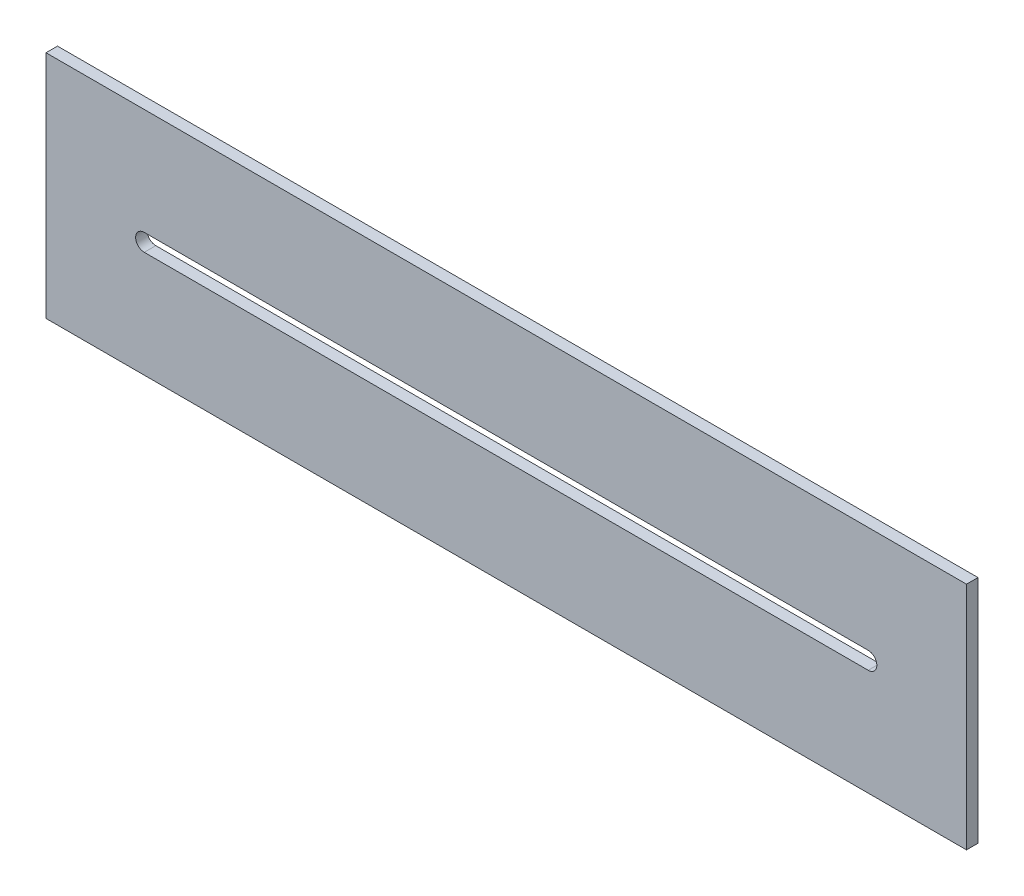
ISO-10303-21;
HEADER;
FILE_DESCRIPTION(('STEP AP214'),'2;1');
FILE_NAME('part.step','',(''),(''),'','','');
FILE_SCHEMA(('AUTOMOTIVE_DESIGN { 1 0 10303 214 1 1 1 1 }'));
ENDSEC;
DATA;
#1=APPLICATION_CONTEXT('core data for automotive mechanical design processes');
#2=APPLICATION_PROTOCOL_DEFINITION('international standard','automotive_design',2000,#1);
#3=PRODUCT_CONTEXT('',#1,'mechanical');
#4=PRODUCT('Part','Part','',(#3));
#5=PRODUCT_RELATED_PRODUCT_CATEGORY('part','',(#4));
#6=PRODUCT_DEFINITION_FORMATION('','',#4);
#7=PRODUCT_DEFINITION_CONTEXT('part definition',#1,'design');
#8=PRODUCT_DEFINITION('design','',#6,#7);
#9=PRODUCT_DEFINITION_SHAPE('','',#8);
#10=(LENGTH_UNIT() NAMED_UNIT(*) SI_UNIT(.MILLI.,.METRE.));
#11=(NAMED_UNIT(*) PLANE_ANGLE_UNIT() SI_UNIT($,.RADIAN.));
#12=(NAMED_UNIT(*) SI_UNIT($,.STERADIAN.) SOLID_ANGLE_UNIT());
#13=UNCERTAINTY_MEASURE_WITH_UNIT(LENGTH_MEASURE(1.E-05),#10,'distance_accuracy_value','');
#14=(GEOMETRIC_REPRESENTATION_CONTEXT(3) GLOBAL_UNCERTAINTY_ASSIGNED_CONTEXT((#13)) GLOBAL_UNIT_ASSIGNED_CONTEXT((#10,
#11,#12)) REPRESENTATION_CONTEXT('',''));
#15=CARTESIAN_POINT('',(0.,0.,0.));
#16=DIRECTION('',(0.,0.,1.));
#17=DIRECTION('',(1.,0.,0.));
#18=AXIS2_PLACEMENT_3D('',#15,#16,#17);
#19=CARTESIAN_POINT('',(-73.8573710965868,28.8913471314452,108.965999999998));
#20=DIRECTION('',(-1.,0.,0.));
#21=DIRECTION('',(0.,0.,1.));
#22=AXIS2_PLACEMENT_3D('',#19,#20,#21);
#23=PLANE('',#22);
#24=DIRECTION('',(0.,-1.,0.));
#25=VECTOR('',#24,1.);
#26=CARTESIAN_POINT('',(-73.8573710965868,28.8913471314452,111.505999999998));
#27=LINE('',#26,#25);
#28=CARTESIAN_POINT('',(-73.8573710965868,28.8913471314452,111.505999999998));
#29=VERTEX_POINT('',#28);
#30=CARTESIAN_POINT('',(-73.8573710965868,-21.9086528685548,111.505999999998));
#31=VERTEX_POINT('',#30);
#32=EDGE_CURVE('E131',#29,#31,#27,.T.);
#33=ORIENTED_EDGE('',*,*,#32,.F.);
#34=DIRECTION('',(0.,0.,1.));
#35=VECTOR('',#34,1.);
#36=CARTESIAN_POINT('',(-73.8573710965868,28.8913471314452,108.965999999998));
#37=LINE('',#36,#35);
#38=CARTESIAN_POINT('',(-73.8573710965868,28.8913471314452,108.965999999998));
#39=VERTEX_POINT('',#38);
#40=EDGE_CURVE('E11',#39,#29,#37,.T.);
#41=ORIENTED_EDGE('',*,*,#40,.F.);
#42=DIRECTION('',(0.,-1.,0.));
#43=VECTOR('',#42,1.);
#44=CARTESIAN_POINT('',(-73.8573710965868,28.8913471314452,108.965999999998));
#45=LINE('',#44,#43);
#46=CARTESIAN_POINT('',(-73.8573710965868,-21.9086528685548,108.965999999998));
#47=VERTEX_POINT('',#46);
#48=EDGE_CURVE('E135',#39,#47,#45,.T.);
#49=ORIENTED_EDGE('',*,*,#48,.T.);
#50=DIRECTION('',(0.,0.,1.));
#51=VECTOR('',#50,1.);
#52=CARTESIAN_POINT('',(-73.8573710965868,-21.9086528685548,108.965999999998));
#53=LINE('',#52,#51);
#54=EDGE_CURVE('E36',#47,#31,#53,.T.);
#55=ORIENTED_EDGE('',*,*,#54,.T.);
#56=EDGE_LOOP('',(#33,#41,#49,#55));
#57=FACE_BOUND('',#56,.T.);
#58=ADVANCED_FACE('F33',(#57),#23,.T.);
#59=CARTESIAN_POINT('',(-73.8573710965868,28.8913471314452,108.965999999998));
#60=DIRECTION('',(0.,1.,0.));
#61=DIRECTION('',(0.,0.,1.));
#62=AXIS2_PLACEMENT_3D('',#59,#60,#61);
#63=PLANE('',#62);
#64=DIRECTION('',(-1.,0.,0.));
#65=VECTOR('',#64,1.);
#66=CARTESIAN_POINT('',(-73.8573710965868,28.8913471314452,111.505999999998));
#67=LINE('',#66,#65);
#68=CARTESIAN_POINT('',(129.342628903413,28.8913471314452,111.505999999998));
#69=VERTEX_POINT('',#68);
#70=EDGE_CURVE('E139',#69,#29,#67,.T.);
#71=ORIENTED_EDGE('',*,*,#70,.F.);
#72=DIRECTION('',(0.,0.,1.));
#73=VECTOR('',#72,1.);
#74=CARTESIAN_POINT('',(129.342628903413,28.8913471314452,108.965999999998));
#75=LINE('',#74,#73);
#76=CARTESIAN_POINT('',(129.342628903413,28.8913471314452,108.965999999998));
#77=VERTEX_POINT('',#76);
#78=EDGE_CURVE('E41',#77,#69,#75,.T.);
#79=ORIENTED_EDGE('',*,*,#78,.F.);
#80=DIRECTION('',(-1.,0.,0.));
#81=VECTOR('',#80,1.);
#82=CARTESIAN_POINT('',(-73.8573710965868,28.8913471314452,108.965999999998));
#83=LINE('',#82,#81);
#84=EDGE_CURVE('E145',#77,#39,#83,.T.);
#85=ORIENTED_EDGE('',*,*,#84,.T.);
#86=ORIENTED_EDGE('',*,*,#40,.T.);
#87=EDGE_LOOP('',(#71,#79,#85,#86));
#88=FACE_BOUND('',#87,.T.);
#89=ADVANCED_FACE('F171',(#88),#63,.T.);
#90=CARTESIAN_POINT('',(129.342628903413,28.8913471314452,108.965999999998));
#91=DIRECTION('',(1.,0.,0.));
#92=DIRECTION('',(0.,0.,-1.));
#93=AXIS2_PLACEMENT_3D('',#90,#91,#92);
#94=PLANE('',#93);
#95=DIRECTION('',(0.,1.,0.));
#96=VECTOR('',#95,1.);
#97=CARTESIAN_POINT('',(129.342628903413,28.8913471314452,111.505999999998));
#98=LINE('',#97,#96);
#99=CARTESIAN_POINT('',(129.342628903413,-21.9086528685548,111.505999999998));
#100=VERTEX_POINT('',#99);
#101=EDGE_CURVE('E153',#100,#69,#98,.T.);
#102=ORIENTED_EDGE('',*,*,#101,.F.);
#103=DIRECTION('',(0.,0.,1.));
#104=VECTOR('',#103,1.);
#105=CARTESIAN_POINT('',(129.342628903413,-21.9086528685548,108.965999999998));
#106=LINE('',#105,#104);
#107=CARTESIAN_POINT('',(129.342628903413,-21.9086528685548,108.965999999998));
#108=VERTEX_POINT('',#107);
#109=EDGE_CURVE('E158',#108,#100,#106,.T.);
#110=ORIENTED_EDGE('',*,*,#109,.F.);
#111=DIRECTION('',(0.,1.,0.));
#112=VECTOR('',#111,1.);
#113=CARTESIAN_POINT('',(129.342628903413,28.8913471314452,108.965999999998));
#114=LINE('',#113,#112);
#115=EDGE_CURVE('E142',#108,#77,#114,.T.);
#116=ORIENTED_EDGE('',*,*,#115,.T.);
#117=ORIENTED_EDGE('',*,*,#78,.T.);
#118=EDGE_LOOP('',(#102,#110,#116,#117));
#119=FACE_BOUND('',#118,.T.);
#120=ADVANCED_FACE('F175',(#119),#94,.T.);
#121=CARTESIAN_POINT('',(-73.8573710965868,-21.9086528685548,108.965999999998));
#122=DIRECTION('',(0.,-1.,0.));
#123=DIRECTION('',(0.,0.,-1.));
#124=AXIS2_PLACEMENT_3D('',#121,#122,#123);
#125=PLANE('',#124);
#126=DIRECTION('',(1.,0.,0.));
#127=VECTOR('',#126,1.);
#128=CARTESIAN_POINT('',(-73.8573710965868,-21.9086528685548,111.505999999998));
#129=LINE('',#128,#127);
#130=EDGE_CURVE('E150',#31,#100,#129,.T.);
#131=ORIENTED_EDGE('',*,*,#130,.F.);
#132=ORIENTED_EDGE('',*,*,#54,.F.);
#133=DIRECTION('',(1.,0.,0.));
#134=VECTOR('',#133,1.);
#135=CARTESIAN_POINT('',(-73.8573710965868,-21.9086528685548,108.965999999998));
#136=LINE('',#135,#134);
#137=EDGE_CURVE('E138',#47,#108,#136,.T.);
#138=ORIENTED_EDGE('',*,*,#137,.T.);
#139=ORIENTED_EDGE('',*,*,#109,.T.);
#140=EDGE_LOOP('',(#131,#132,#138,#139));
#141=FACE_BOUND('',#140,.T.);
#142=ADVANCED_FACE('F166',(#141),#125,.T.);
#143=CARTESIAN_POINT('',(0.,0.,108.965999999998));
#144=DIRECTION('',(0.,0.,1.));
#145=DIRECTION('',(1.,0.,0.));
#146=AXIS2_PLACEMENT_3D('',#143,#144,#145);
#147=PLANE('',#146);
#148=DIRECTION('',(-1.,0.,0.));
#149=VECTOR('',#148,1.);
#150=CARTESIAN_POINT('',(-52.1649963689179,5.39634713144519,108.965999999998));
#151=LINE('',#150,#149);
#152=CARTESIAN_POINT('',(107.650254175744,5.39634713144519,108.965999999998));
#153=VERTEX_POINT('',#152);
#154=CARTESIAN_POINT('',(-52.1649963689179,5.39634713144519,108.965999999998));
#155=VERTEX_POINT('',#154);
#156=EDGE_CURVE('E106',#153,#155,#151,.T.);
#157=ORIENTED_EDGE('',*,*,#156,.T.);
#158=CARTESIAN_POINT('',(-52.1649963689179,3.49134713144519,108.965999999998));
#159=DIRECTION('',(0.,0.,1.));
#160=DIRECTION('',(1.,0.,0.));
#161=AXIS2_PLACEMENT_3D('',#158,#159,#160);
#162=CIRCLE('',#161,1.905);
#163=CARTESIAN_POINT('',(-52.1649963689179,1.58634713144519,108.965999999998));
#164=VERTEX_POINT('',#163);
#165=EDGE_CURVE('E100',#155,#164,#162,.T.);
#166=ORIENTED_EDGE('',*,*,#165,.T.);
#167=DIRECTION('',(1.,0.,0.));
#168=VECTOR('',#167,1.);
#169=CARTESIAN_POINT('',(-52.1649963689179,1.58634713144519,108.965999999998));
#170=LINE('',#169,#168);
#171=CARTESIAN_POINT('',(107.650254175744,1.58634713144519,108.965999999998));
#172=VERTEX_POINT('',#171);
#173=EDGE_CURVE('E109',#164,#172,#170,.T.);
#174=ORIENTED_EDGE('',*,*,#173,.T.);
#175=CARTESIAN_POINT('',(107.650254175744,3.49134713144519,108.965999999998));
#176=DIRECTION('',(0.,0.,1.));
#177=DIRECTION('',(1.,0.,0.));
#178=AXIS2_PLACEMENT_3D('',#175,#176,#177);
#179=CIRCLE('',#178,1.905);
#180=EDGE_CURVE('E49',#172,#153,#179,.T.);
#181=ORIENTED_EDGE('',*,*,#180,.T.);
#182=EDGE_LOOP('',(#157,#166,#174,#181));
#183=FACE_BOUND('',#182,.T.);
#184=ORIENTED_EDGE('',*,*,#48,.F.);
#185=ORIENTED_EDGE('',*,*,#84,.F.);
#186=ORIENTED_EDGE('',*,*,#115,.F.);
#187=ORIENTED_EDGE('',*,*,#137,.F.);
#188=EDGE_LOOP('',(#184,#185,#186,#187));
#189=FACE_BOUND('',#188,.T.);
#190=ADVANCED_FACE('F113',(#183,#189),#147,.F.);
#191=CARTESIAN_POINT('',(0.,0.,111.505999999998));
#192=DIRECTION('',(0.,0.,1.));
#193=DIRECTION('',(1.,0.,0.));
#194=AXIS2_PLACEMENT_3D('',#191,#192,#193);
#195=PLANE('',#194);
#196=CARTESIAN_POINT('',(-52.1649963689179,3.49134713144519,111.505999999998));
#197=DIRECTION('',(0.,0.,1.));
#198=DIRECTION('',(1.,0.,0.));
#199=AXIS2_PLACEMENT_3D('',#196,#197,#198);
#200=CIRCLE('',#199,1.905);
#201=CARTESIAN_POINT('',(-52.1649963689179,5.39634713144519,111.505999999998));
#202=VERTEX_POINT('',#201);
#203=CARTESIAN_POINT('',(-52.1649963689179,1.58634713144519,111.505999999998));
#204=VERTEX_POINT('',#203);
#205=EDGE_CURVE('E57',#202,#204,#200,.T.);
#206=ORIENTED_EDGE('',*,*,#205,.F.);
#207=DIRECTION('',(-1.,0.,0.));
#208=VECTOR('',#207,1.);
#209=CARTESIAN_POINT('',(-52.1649963689179,5.39634713144519,111.505999999998));
#210=LINE('',#209,#208);
#211=CARTESIAN_POINT('',(107.650254175744,5.39634713144519,111.505999999998));
#212=VERTEX_POINT('',#211);
#213=EDGE_CURVE('E116',#212,#202,#210,.T.);
#214=ORIENTED_EDGE('',*,*,#213,.F.);
#215=CARTESIAN_POINT('',(107.650254175744,3.49134713144519,111.505999999998));
#216=DIRECTION('',(0.,0.,1.));
#217=DIRECTION('',(1.,0.,0.));
#218=AXIS2_PLACEMENT_3D('',#215,#216,#217);
#219=CIRCLE('',#218,1.905);
#220=CARTESIAN_POINT('',(107.650254175744,1.58634713144519,111.505999999998));
#221=VERTEX_POINT('',#220);
#222=EDGE_CURVE('E119',#221,#212,#219,.T.);
#223=ORIENTED_EDGE('',*,*,#222,.F.);
#224=DIRECTION('',(1.,0.,0.));
#225=VECTOR('',#224,1.);
#226=CARTESIAN_POINT('',(-52.1649963689179,1.58634713144519,111.505999999998));
#227=LINE('',#226,#225);
#228=EDGE_CURVE('E125',#204,#221,#227,.T.);
#229=ORIENTED_EDGE('',*,*,#228,.F.);
#230=EDGE_LOOP('',(#206,#214,#223,#229));
#231=FACE_BOUND('',#230,.T.);
#232=ORIENTED_EDGE('',*,*,#32,.T.);
#233=ORIENTED_EDGE('',*,*,#130,.T.);
#234=ORIENTED_EDGE('',*,*,#101,.T.);
#235=ORIENTED_EDGE('',*,*,#70,.T.);
#236=EDGE_LOOP('',(#232,#233,#234,#235));
#237=FACE_BOUND('',#236,.T.);
#238=ADVANCED_FACE('F168',(#231,#237),#195,.T.);
#239=CARTESIAN_POINT('',(-52.1649963689179,3.49134713144519,108.965999999998));
#240=DIRECTION('',(0.,0.,1.));
#241=DIRECTION('',(1.,0.,0.));
#242=AXIS2_PLACEMENT_3D('',#239,#240,#241);
#243=CYLINDRICAL_SURFACE('',#242,1.905);
#244=ORIENTED_EDGE('',*,*,#205,.T.);
#245=DIRECTION('',(0.,0.,1.));
#246=VECTOR('',#245,1.);
#247=CARTESIAN_POINT('',(-52.1649963689179,1.58634713144519,108.965999999998));
#248=LINE('',#247,#246);
#249=EDGE_CURVE('E96',#164,#204,#248,.T.);
#250=ORIENTED_EDGE('',*,*,#249,.F.);
#251=ORIENTED_EDGE('',*,*,#165,.F.);
#252=DIRECTION('',(0.,0.,1.));
#253=VECTOR('',#252,1.);
#254=CARTESIAN_POINT('',(-52.1649963689179,5.39634713144519,108.965999999998));
#255=LINE('',#254,#253);
#256=EDGE_CURVE('E129',#155,#202,#255,.T.);
#257=ORIENTED_EDGE('',*,*,#256,.T.);
#258=EDGE_LOOP('',(#244,#250,#251,#257));
#259=FACE_BOUND('',#258,.T.);
#260=ADVANCED_FACE('F98',(#259),#243,.F.);
#261=CARTESIAN_POINT('',(-52.1649963689179,5.39634713144519,108.965999999998));
#262=DIRECTION('',(0.,1.,0.));
#263=DIRECTION('',(0.,0.,1.));
#264=AXIS2_PLACEMENT_3D('',#261,#262,#263);
#265=PLANE('',#264);
#266=ORIENTED_EDGE('',*,*,#213,.T.);
#267=ORIENTED_EDGE('',*,*,#256,.F.);
#268=ORIENTED_EDGE('',*,*,#156,.F.);
#269=DIRECTION('',(0.,0.,1.));
#270=VECTOR('',#269,1.);
#271=CARTESIAN_POINT('',(107.650254175744,5.39634713144519,108.965999999998));
#272=LINE('',#271,#270);
#273=EDGE_CURVE('E132',#153,#212,#272,.T.);
#274=ORIENTED_EDGE('',*,*,#273,.T.);
#275=EDGE_LOOP('',(#266,#267,#268,#274));
#276=FACE_BOUND('',#275,.T.);
#277=ADVANCED_FACE('F226',(#276),#265,.F.);
#278=CARTESIAN_POINT('',(107.650254175744,3.49134713144519,108.965999999998));
#279=DIRECTION('',(0.,0.,1.));
#280=DIRECTION('',(1.,0.,0.));
#281=AXIS2_PLACEMENT_3D('',#278,#279,#280);
#282=CYLINDRICAL_SURFACE('',#281,1.905);
#283=ORIENTED_EDGE('',*,*,#222,.T.);
#284=ORIENTED_EDGE('',*,*,#273,.F.);
#285=ORIENTED_EDGE('',*,*,#180,.F.);
#286=DIRECTION('',(0.,0.,1.));
#287=VECTOR('',#286,1.);
#288=CARTESIAN_POINT('',(107.650254175744,1.58634713144519,108.965999999998));
#289=LINE('',#288,#287);
#290=EDGE_CURVE('E105',#172,#221,#289,.T.);
#291=ORIENTED_EDGE('',*,*,#290,.T.);
#292=EDGE_LOOP('',(#283,#284,#285,#291));
#293=FACE_BOUND('',#292,.T.);
#294=ADVANCED_FACE('F235',(#293),#282,.F.);
#295=CARTESIAN_POINT('',(-52.1649963689179,1.58634713144519,108.965999999998));
#296=DIRECTION('',(0.,-1.,0.));
#297=DIRECTION('',(0.,0.,-1.));
#298=AXIS2_PLACEMENT_3D('',#295,#296,#297);
#299=PLANE('',#298);
#300=ORIENTED_EDGE('',*,*,#228,.T.);
#301=ORIENTED_EDGE('',*,*,#290,.F.);
#302=ORIENTED_EDGE('',*,*,#173,.F.);
#303=ORIENTED_EDGE('',*,*,#249,.T.);
#304=EDGE_LOOP('',(#300,#301,#302,#303));
#305=FACE_BOUND('',#304,.T.);
#306=ADVANCED_FACE('F110',(#305),#299,.F.);
#307=CLOSED_SHELL('',(#58,#89,#120,#142,#190,#238,#260,#277,#294,#306));
#308=MANIFOLD_SOLID_BREP('B2',#307);
#309=ADVANCED_BREP_SHAPE_REPRESENTATION('',(#18,#308),#14);
#310=SHAPE_DEFINITION_REPRESENTATION(#9,#309);
ENDSEC;
END-ISO-10303-21;
